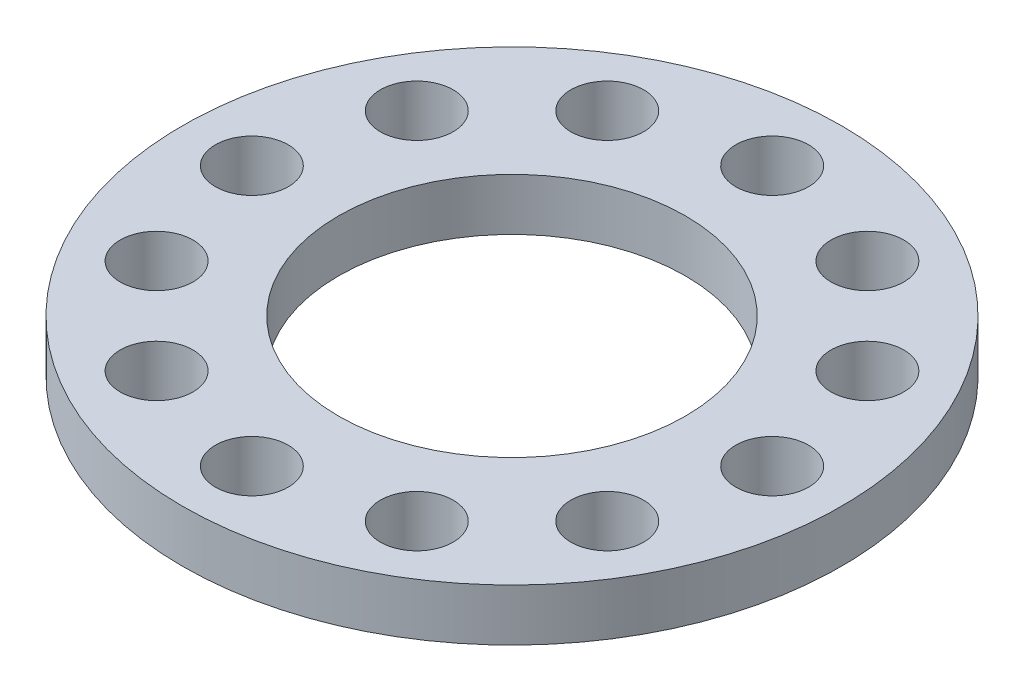
ISO-10303-21;
HEADER;
FILE_DESCRIPTION(('STEP AP214'),'2;1');
FILE_NAME('part.step','',(''),(''),'','','');
FILE_SCHEMA(('AUTOMOTIVE_DESIGN { 1 0 10303 214 1 1 1 1 }'));
ENDSEC;
DATA;
#1=APPLICATION_CONTEXT('core data for automotive mechanical design processes');
#2=APPLICATION_PROTOCOL_DEFINITION('international standard','automotive_design',2000,#1);
#3=PRODUCT_CONTEXT('',#1,'mechanical');
#4=PRODUCT('Part','Part','',(#3));
#5=PRODUCT_RELATED_PRODUCT_CATEGORY('part','',(#4));
#6=PRODUCT_DEFINITION_FORMATION('','',#4);
#7=PRODUCT_DEFINITION_CONTEXT('part definition',#1,'design');
#8=PRODUCT_DEFINITION('design','',#6,#7);
#9=PRODUCT_DEFINITION_SHAPE('','',#8);
#10=(LENGTH_UNIT() NAMED_UNIT(*) SI_UNIT(.MILLI.,.METRE.));
#11=(NAMED_UNIT(*) PLANE_ANGLE_UNIT() SI_UNIT($,.RADIAN.));
#12=(NAMED_UNIT(*) SI_UNIT($,.STERADIAN.) SOLID_ANGLE_UNIT());
#13=UNCERTAINTY_MEASURE_WITH_UNIT(LENGTH_MEASURE(1.E-05),#10,'distance_accuracy_value','');
#14=(GEOMETRIC_REPRESENTATION_CONTEXT(3) GLOBAL_UNCERTAINTY_ASSIGNED_CONTEXT((#13)) GLOBAL_UNIT_ASSIGNED_CONTEXT((#10,
#11,#12)) REPRESENTATION_CONTEXT('',''));
#15=CARTESIAN_POINT('',(0.,0.,0.));
#16=DIRECTION('',(0.,0.,1.));
#17=DIRECTION('',(1.,0.,0.));
#18=AXIS2_PLACEMENT_3D('',#15,#16,#17);
#19=CARTESIAN_POINT('',(0.,3.,0.));
#20=DIRECTION('',(0.,-1.,0.));
#21=DIRECTION('',(0.,0.,-1.));
#22=AXIS2_PLACEMENT_3D('',#19,#20,#21);
#23=CYLINDRICAL_SURFACE('',#22,19.);
#24=CARTESIAN_POINT('',(0.,3.,0.));
#25=DIRECTION('',(0.,1.,0.));
#26=DIRECTION('',(0.,0.,1.));
#27=AXIS2_PLACEMENT_3D('',#24,#25,#26);
#28=CIRCLE('',#27,19.);
#29=CARTESIAN_POINT('',(0.,3.,19.));
#30=VERTEX_POINT('',#29);
#31=EDGE_CURVE('E10',#30,#30,#28,.T.);
#32=ORIENTED_EDGE('',*,*,#31,.F.);
#33=EDGE_LOOP('',(#32));
#34=FACE_BOUND('',#33,.T.);
#35=CARTESIAN_POINT('',(0.,0.,0.));
#36=DIRECTION('',(0.,1.,0.));
#37=DIRECTION('',(0.,0.,1.));
#38=AXIS2_PLACEMENT_3D('',#35,#36,#37);
#39=CIRCLE('',#38,19.);
#40=CARTESIAN_POINT('',(0.,0.,19.));
#41=VERTEX_POINT('',#40);
#42=EDGE_CURVE('E34',#41,#41,#39,.T.);
#43=ORIENTED_EDGE('',*,*,#42,.T.);
#44=EDGE_LOOP('',(#43));
#45=FACE_BOUND('',#44,.T.);
#46=ADVANCED_FACE('F31',(#34,#45),#23,.T.);
#47=CARTESIAN_POINT('',(0.,3.,0.));
#48=DIRECTION('',(0.,1.,0.));
#49=DIRECTION('',(0.,0.,1.));
#50=AXIS2_PLACEMENT_3D('',#47,#48,#49);
#51=PLANE('',#50);
#52=CARTESIAN_POINT('',(0.,3.,0.));
#53=DIRECTION('',(0.,1.,0.));
#54=DIRECTION('',(0.,0.,1.));
#55=AXIS2_PLACEMENT_3D('',#52,#53,#54);
#56=CIRCLE('',#55,10.);
#57=CARTESIAN_POINT('',(0.,3.,10.));
#58=VERTEX_POINT('',#57);
#59=EDGE_CURVE('E117',#58,#58,#56,.T.);
#60=ORIENTED_EDGE('',*,*,#59,.F.);
#61=EDGE_LOOP('',(#60));
#62=FACE_BOUND('',#61,.T.);
#63=CARTESIAN_POINT('',(-7.49999999999992,3.,-12.9903810567663));
#64=DIRECTION('',(0.,1.,0.));
#65=DIRECTION('',(0.,0.,1.));
#66=AXIS2_PLACEMENT_3D('',#63,#64,#65);
#67=CIRCLE('',#66,2.10000000000037);
#68=CARTESIAN_POINT('',(-7.49999999999992,3.,-10.8903810567659));
#69=VERTEX_POINT('',#68);
#70=EDGE_CURVE('E111',#69,#69,#67,.T.);
#71=ORIENTED_EDGE('',*,*,#70,.F.);
#72=EDGE_LOOP('',(#71));
#73=FACE_BOUND('',#72,.T.);
#74=CARTESIAN_POINT('',(-12.9903810567663,3.,-7.49999999999944));
#75=DIRECTION('',(0.,1.,0.));
#76=DIRECTION('',(0.,0.,1.));
#77=AXIS2_PLACEMENT_3D('',#74,#75,#76);
#78=CIRCLE('',#77,2.10000000000064);
#79=CARTESIAN_POINT('',(-12.9903810567663,3.,-5.39999999999879));
#80=VERTEX_POINT('',#79);
#81=EDGE_CURVE('E105',#80,#80,#78,.T.);
#82=ORIENTED_EDGE('',*,*,#81,.F.);
#83=EDGE_LOOP('',(#82));
#84=FACE_BOUND('',#83,.T.);
#85=CARTESIAN_POINT('',(-14.9999999999994,3.,6.3948846218409E-13));
#86=DIRECTION('',(0.,1.,0.));
#87=DIRECTION('',(0.,0.,1.));
#88=AXIS2_PLACEMENT_3D('',#85,#86,#87);
#89=CIRCLE('',#88,2.10000000000095);
#90=CARTESIAN_POINT('',(-14.9999999999994,3.,2.10000000000159));
#91=VERTEX_POINT('',#90);
#92=EDGE_CURVE('E99',#91,#91,#89,.T.);
#93=ORIENTED_EDGE('',*,*,#92,.F.);
#94=EDGE_LOOP('',(#93));
#95=FACE_BOUND('',#94,.T.);
#96=CARTESIAN_POINT('',(-12.9903810567656,3.,7.50000000000056));
#97=DIRECTION('',(0.,1.,0.));
#98=DIRECTION('',(0.,0.,1.));
#99=AXIS2_PLACEMENT_3D('',#96,#97,#98);
#100=CIRCLE('',#99,2.10000000000122);
#101=CARTESIAN_POINT('',(-12.9903810567656,3.,9.60000000000178));
#102=VERTEX_POINT('',#101);
#103=EDGE_CURVE('E93',#102,#102,#100,.T.);
#104=ORIENTED_EDGE('',*,*,#103,.F.);
#105=EDGE_LOOP('',(#104));
#106=FACE_BOUND('',#105,.T.);
#107=CARTESIAN_POINT('',(-7.49999999999881,3.,12.9903810567669));
#108=DIRECTION('',(0.,1.,0.));
#109=DIRECTION('',(0.,0.,1.));
#110=AXIS2_PLACEMENT_3D('',#107,#108,#109);
#111=CIRCLE('',#110,2.10000000000135);
#112=CARTESIAN_POINT('',(-7.49999999999881,3.,15.0903810567683));
#113=VERTEX_POINT('',#112);
#114=EDGE_CURVE('E87',#113,#113,#111,.T.);
#115=ORIENTED_EDGE('',*,*,#114,.F.);
#116=EDGE_LOOP('',(#115));
#117=FACE_BOUND('',#116,.T.);
#118=CARTESIAN_POINT('',(1.27530298397074E-12,3.,15.));
#119=DIRECTION('',(0.,1.,0.));
#120=DIRECTION('',(0.,0.,1.));
#121=AXIS2_PLACEMENT_3D('',#118,#119,#120);
#122=CIRCLE('',#121,2.10000000000132);
#123=CARTESIAN_POINT('',(1.27530298397074E-12,3.,17.1000000000013));
#124=VERTEX_POINT('',#123);
#125=EDGE_CURVE('E81',#124,#124,#122,.T.);
#126=ORIENTED_EDGE('',*,*,#125,.F.);
#127=EDGE_LOOP('',(#126));
#128=FACE_BOUND('',#127,.T.);
#129=CARTESIAN_POINT('',(7.50000000000119,3.,12.9903810567663));
#130=DIRECTION('',(0.,1.,0.));
#131=DIRECTION('',(0.,0.,1.));
#132=AXIS2_PLACEMENT_3D('',#129,#130,#131);
#133=CIRCLE('',#132,2.10000000000113);
#134=CARTESIAN_POINT('',(7.50000000000119,3.,15.0903810567674));
#135=VERTEX_POINT('',#134);
#136=EDGE_CURVE('E75',#135,#135,#133,.T.);
#137=ORIENTED_EDGE('',*,*,#136,.F.);
#138=EDGE_LOOP('',(#137));
#139=FACE_BOUND('',#138,.T.);
#140=CARTESIAN_POINT('',(12.9903810567675,3.,7.49999999999945));
#141=DIRECTION('',(0.,1.,0.));
#142=DIRECTION('',(0.,0.,1.));
#143=AXIS2_PLACEMENT_3D('',#140,#141,#142);
#144=CIRCLE('',#143,2.10000000000082);
#145=CARTESIAN_POINT('',(12.9903810567675,3.,9.60000000000027));
#146=VERTEX_POINT('',#145);
#147=EDGE_CURVE('E69',#146,#146,#144,.T.);
#148=ORIENTED_EDGE('',*,*,#147,.F.);
#149=EDGE_LOOP('',(#148));
#150=FACE_BOUND('',#149,.T.);
#151=CARTESIAN_POINT('',(15.0000000000006,3.,-6.37651491985369E-13));
#152=DIRECTION('',(0.,1.,0.));
#153=DIRECTION('',(0.,0.,1.));
#154=AXIS2_PLACEMENT_3D('',#151,#152,#153);
#155=CIRCLE('',#154,2.10000000000047);
#156=CARTESIAN_POINT('',(15.0000000000006,3.,2.09999999999984));
#157=VERTEX_POINT('',#156);
#158=EDGE_CURVE('E63',#157,#157,#155,.T.);
#159=ORIENTED_EDGE('',*,*,#158,.F.);
#160=EDGE_LOOP('',(#159));
#161=FACE_BOUND('',#160,.T.);
#162=CARTESIAN_POINT('',(12.9903810567669,3.,-7.50000000000055));
#163=DIRECTION('',(0.,1.,0.));
#164=DIRECTION('',(0.,0.,1.));
#165=AXIS2_PLACEMENT_3D('',#162,#163,#164);
#166=CIRCLE('',#165,2.10000000000018);
#167=CARTESIAN_POINT('',(12.9903810567669,3.,-5.40000000000038));
#168=VERTEX_POINT('',#167);
#169=EDGE_CURVE('E57',#168,#168,#166,.T.);
#170=ORIENTED_EDGE('',*,*,#169,.F.);
#171=EDGE_LOOP('',(#170));
#172=FACE_BOUND('',#171,.T.);
#173=CARTESIAN_POINT('',(7.50000000000001,3.,-12.9903810567666));
#174=DIRECTION('',(0.,1.,0.));
#175=DIRECTION('',(0.,0.,1.));
#176=AXIS2_PLACEMENT_3D('',#173,#174,#175);
#177=CIRCLE('',#176,2.1);
#178=CARTESIAN_POINT('',(7.50000000000001,3.,-10.8903810567666));
#179=VERTEX_POINT('',#178);
#180=EDGE_CURVE('E51',#179,#179,#177,.T.);
#181=ORIENTED_EDGE('',*,*,#180,.F.);
#182=EDGE_LOOP('',(#181));
#183=FACE_BOUND('',#182,.T.);
#184=CARTESIAN_POINT('',(0.,3.,-15.));
#185=DIRECTION('',(0.,1.,0.));
#186=DIRECTION('',(0.,0.,1.));
#187=AXIS2_PLACEMENT_3D('',#184,#185,#186);
#188=CIRCLE('',#187,2.1);
#189=CARTESIAN_POINT('',(0.,3.,-12.9));
#190=VERTEX_POINT('',#189);
#191=EDGE_CURVE('E45',#190,#190,#188,.T.);
#192=ORIENTED_EDGE('',*,*,#191,.F.);
#193=EDGE_LOOP('',(#192));
#194=FACE_BOUND('',#193,.T.);
#195=ORIENTED_EDGE('',*,*,#31,.T.);
#196=EDGE_LOOP('',(#195));
#197=FACE_BOUND('',#196,.T.);
#198=ADVANCED_FACE('F124',(#62,#73,#84,#95,#106,#117,#128,#139,#150,#161,#172,#183,#194,#197),
#51,.T.);
#199=CARTESIAN_POINT('',(0.,0.,0.));
#200=DIRECTION('',(0.,1.,0.));
#201=DIRECTION('',(0.,0.,1.));
#202=AXIS2_PLACEMENT_3D('',#199,#200,#201);
#203=PLANE('',#202);
#204=CARTESIAN_POINT('',(0.,0.,0.));
#205=DIRECTION('',(0.,1.,0.));
#206=DIRECTION('',(0.,0.,1.));
#207=AXIS2_PLACEMENT_3D('',#204,#205,#206);
#208=CIRCLE('',#207,10.);
#209=CARTESIAN_POINT('',(0.,0.,10.));
#210=VERTEX_POINT('',#209);
#211=EDGE_CURVE('E114',#210,#210,#208,.F.);
#212=ORIENTED_EDGE('',*,*,#211,.F.);
#213=EDGE_LOOP('',(#212));
#214=FACE_BOUND('',#213,.T.);
#215=CARTESIAN_POINT('',(-7.49999999999992,0.,-12.9903810567663));
#216=DIRECTION('',(0.,1.,0.));
#217=DIRECTION('',(0.,0.,1.));
#218=AXIS2_PLACEMENT_3D('',#215,#216,#217);
#219=CIRCLE('',#218,2.10000000000037);
#220=CARTESIAN_POINT('',(-7.49999999999992,0.,-10.8903810567659));
#221=VERTEX_POINT('',#220);
#222=EDGE_CURVE('E108',#221,#221,#219,.F.);
#223=ORIENTED_EDGE('',*,*,#222,.F.);
#224=EDGE_LOOP('',(#223));
#225=FACE_BOUND('',#224,.T.);
#226=CARTESIAN_POINT('',(-12.9903810567663,0.,-7.49999999999944));
#227=DIRECTION('',(0.,1.,0.));
#228=DIRECTION('',(0.,0.,1.));
#229=AXIS2_PLACEMENT_3D('',#226,#227,#228);
#230=CIRCLE('',#229,2.10000000000064);
#231=CARTESIAN_POINT('',(-12.9903810567663,0.,-5.39999999999879));
#232=VERTEX_POINT('',#231);
#233=EDGE_CURVE('E102',#232,#232,#230,.F.);
#234=ORIENTED_EDGE('',*,*,#233,.F.);
#235=EDGE_LOOP('',(#234));
#236=FACE_BOUND('',#235,.T.);
#237=CARTESIAN_POINT('',(-14.9999999999994,0.,6.3948846218409E-13));
#238=DIRECTION('',(0.,1.,0.));
#239=DIRECTION('',(0.,0.,1.));
#240=AXIS2_PLACEMENT_3D('',#237,#238,#239);
#241=CIRCLE('',#240,2.10000000000095);
#242=CARTESIAN_POINT('',(-14.9999999999994,0.,2.10000000000159));
#243=VERTEX_POINT('',#242);
#244=EDGE_CURVE('E96',#243,#243,#241,.F.);
#245=ORIENTED_EDGE('',*,*,#244,.F.);
#246=EDGE_LOOP('',(#245));
#247=FACE_BOUND('',#246,.T.);
#248=CARTESIAN_POINT('',(-12.9903810567656,0.,7.50000000000056));
#249=DIRECTION('',(0.,1.,0.));
#250=DIRECTION('',(0.,0.,1.));
#251=AXIS2_PLACEMENT_3D('',#248,#249,#250);
#252=CIRCLE('',#251,2.10000000000122);
#253=CARTESIAN_POINT('',(-12.9903810567656,0.,9.60000000000178));
#254=VERTEX_POINT('',#253);
#255=EDGE_CURVE('E90',#254,#254,#252,.F.);
#256=ORIENTED_EDGE('',*,*,#255,.F.);
#257=EDGE_LOOP('',(#256));
#258=FACE_BOUND('',#257,.T.);
#259=CARTESIAN_POINT('',(-7.49999999999881,0.,12.9903810567669));
#260=DIRECTION('',(0.,1.,0.));
#261=DIRECTION('',(0.,0.,1.));
#262=AXIS2_PLACEMENT_3D('',#259,#260,#261);
#263=CIRCLE('',#262,2.10000000000135);
#264=CARTESIAN_POINT('',(-7.49999999999881,0.,15.0903810567683));
#265=VERTEX_POINT('',#264);
#266=EDGE_CURVE('E84',#265,#265,#263,.F.);
#267=ORIENTED_EDGE('',*,*,#266,.F.);
#268=EDGE_LOOP('',(#267));
#269=FACE_BOUND('',#268,.T.);
#270=CARTESIAN_POINT('',(1.27530298397074E-12,0.,15.));
#271=DIRECTION('',(0.,1.,0.));
#272=DIRECTION('',(0.,0.,1.));
#273=AXIS2_PLACEMENT_3D('',#270,#271,#272);
#274=CIRCLE('',#273,2.10000000000132);
#275=CARTESIAN_POINT('',(1.27530298397074E-12,0.,17.1000000000013));
#276=VERTEX_POINT('',#275);
#277=EDGE_CURVE('E78',#276,#276,#274,.F.);
#278=ORIENTED_EDGE('',*,*,#277,.F.);
#279=EDGE_LOOP('',(#278));
#280=FACE_BOUND('',#279,.T.);
#281=CARTESIAN_POINT('',(7.50000000000119,0.,12.9903810567663));
#282=DIRECTION('',(0.,1.,0.));
#283=DIRECTION('',(0.,0.,1.));
#284=AXIS2_PLACEMENT_3D('',#281,#282,#283);
#285=CIRCLE('',#284,2.10000000000113);
#286=CARTESIAN_POINT('',(7.50000000000119,0.,15.0903810567674));
#287=VERTEX_POINT('',#286);
#288=EDGE_CURVE('E72',#287,#287,#285,.F.);
#289=ORIENTED_EDGE('',*,*,#288,.F.);
#290=EDGE_LOOP('',(#289));
#291=FACE_BOUND('',#290,.T.);
#292=CARTESIAN_POINT('',(12.9903810567675,0.,7.49999999999945));
#293=DIRECTION('',(0.,1.,0.));
#294=DIRECTION('',(0.,0.,1.));
#295=AXIS2_PLACEMENT_3D('',#292,#293,#294);
#296=CIRCLE('',#295,2.10000000000082);
#297=CARTESIAN_POINT('',(12.9903810567675,0.,9.60000000000027));
#298=VERTEX_POINT('',#297);
#299=EDGE_CURVE('E66',#298,#298,#296,.F.);
#300=ORIENTED_EDGE('',*,*,#299,.F.);
#301=EDGE_LOOP('',(#300));
#302=FACE_BOUND('',#301,.T.);
#303=CARTESIAN_POINT('',(15.0000000000006,0.,-6.37651491985369E-13));
#304=DIRECTION('',(0.,1.,0.));
#305=DIRECTION('',(0.,0.,1.));
#306=AXIS2_PLACEMENT_3D('',#303,#304,#305);
#307=CIRCLE('',#306,2.10000000000047);
#308=CARTESIAN_POINT('',(15.0000000000006,0.,2.09999999999984));
#309=VERTEX_POINT('',#308);
#310=EDGE_CURVE('E60',#309,#309,#307,.F.);
#311=ORIENTED_EDGE('',*,*,#310,.F.);
#312=EDGE_LOOP('',(#311));
#313=FACE_BOUND('',#312,.T.);
#314=CARTESIAN_POINT('',(12.9903810567669,0.,-7.50000000000055));
#315=DIRECTION('',(0.,1.,0.));
#316=DIRECTION('',(0.,0.,1.));
#317=AXIS2_PLACEMENT_3D('',#314,#315,#316);
#318=CIRCLE('',#317,2.10000000000018);
#319=CARTESIAN_POINT('',(12.9903810567669,0.,-5.40000000000038));
#320=VERTEX_POINT('',#319);
#321=EDGE_CURVE('E54',#320,#320,#318,.F.);
#322=ORIENTED_EDGE('',*,*,#321,.F.);
#323=EDGE_LOOP('',(#322));
#324=FACE_BOUND('',#323,.T.);
#325=CARTESIAN_POINT('',(7.50000000000001,0.,-12.9903810567666));
#326=DIRECTION('',(0.,1.,0.));
#327=DIRECTION('',(0.,0.,1.));
#328=AXIS2_PLACEMENT_3D('',#325,#326,#327);
#329=CIRCLE('',#328,2.1);
#330=CARTESIAN_POINT('',(7.50000000000001,0.,-10.8903810567666));
#331=VERTEX_POINT('',#330);
#332=EDGE_CURVE('E48',#331,#331,#329,.F.);
#333=ORIENTED_EDGE('',*,*,#332,.F.);
#334=EDGE_LOOP('',(#333));
#335=FACE_BOUND('',#334,.T.);
#336=CARTESIAN_POINT('',(0.,0.,-15.));
#337=DIRECTION('',(0.,1.,0.));
#338=DIRECTION('',(0.,0.,1.));
#339=AXIS2_PLACEMENT_3D('',#336,#337,#338);
#340=CIRCLE('',#339,2.1);
#341=CARTESIAN_POINT('',(0.,0.,-12.9));
#342=VERTEX_POINT('',#341);
#343=EDGE_CURVE('E41',#342,#342,#340,.F.);
#344=ORIENTED_EDGE('',*,*,#343,.F.);
#345=EDGE_LOOP('',(#344));
#346=FACE_BOUND('',#345,.T.);
#347=ORIENTED_EDGE('',*,*,#42,.F.);
#348=EDGE_LOOP('',(#347));
#349=FACE_BOUND('',#348,.T.);
#350=ADVANCED_FACE('F127',(#214,#225,#236,#247,#258,#269,#280,#291,#302,#313,#324,#335,#346,
#349),#203,.F.);
#351=CARTESIAN_POINT('',(0.,-0.00100000000000013,-15.));
#352=DIRECTION('',(0.,1.,0.));
#353=DIRECTION('',(0.,0.,1.));
#354=AXIS2_PLACEMENT_3D('',#351,#352,#353);
#355=CYLINDRICAL_SURFACE('',#354,2.1);
#356=ORIENTED_EDGE('',*,*,#191,.T.);
#357=EDGE_LOOP('',(#356));
#358=FACE_BOUND('',#357,.T.);
#359=ORIENTED_EDGE('',*,*,#343,.T.);
#360=EDGE_LOOP('',(#359));
#361=FACE_BOUND('',#360,.T.);
#362=ADVANCED_FACE('F153',(#358,#361),#355,.F.);
#363=CARTESIAN_POINT('',(7.50000000000001,-0.00100000000000013,-12.9903810567666));
#364=DIRECTION('',(0.,1.,0.));
#365=DIRECTION('',(0.,0.,1.));
#366=AXIS2_PLACEMENT_3D('',#363,#364,#365);
#367=CYLINDRICAL_SURFACE('',#366,2.1);
#368=ORIENTED_EDGE('',*,*,#180,.T.);
#369=EDGE_LOOP('',(#368));
#370=FACE_BOUND('',#369,.T.);
#371=ORIENTED_EDGE('',*,*,#332,.T.);
#372=EDGE_LOOP('',(#371));
#373=FACE_BOUND('',#372,.T.);
#374=ADVANCED_FACE('F156',(#370,#373),#367,.F.);
#375=CARTESIAN_POINT('',(12.9903810567669,-0.00100000000000013,-7.50000000000055));
#376=DIRECTION('',(0.,1.,0.));
#377=DIRECTION('',(0.,0.,1.));
#378=AXIS2_PLACEMENT_3D('',#375,#376,#377);
#379=CYLINDRICAL_SURFACE('',#378,2.10000000000018);
#380=ORIENTED_EDGE('',*,*,#169,.T.);
#381=EDGE_LOOP('',(#380));
#382=FACE_BOUND('',#381,.T.);
#383=ORIENTED_EDGE('',*,*,#321,.T.);
#384=EDGE_LOOP('',(#383));
#385=FACE_BOUND('',#384,.T.);
#386=ADVANCED_FACE('F189',(#382,#385),#379,.F.);
#387=CARTESIAN_POINT('',(15.0000000000006,-0.00100000000000013,-6.37651491985369E-13));
#388=DIRECTION('',(0.,1.,0.));
#389=DIRECTION('',(0.,0.,1.));
#390=AXIS2_PLACEMENT_3D('',#387,#388,#389);
#391=CYLINDRICAL_SURFACE('',#390,2.10000000000047);
#392=ORIENTED_EDGE('',*,*,#158,.T.);
#393=EDGE_LOOP('',(#392));
#394=FACE_BOUND('',#393,.T.);
#395=ORIENTED_EDGE('',*,*,#310,.T.);
#396=EDGE_LOOP('',(#395));
#397=FACE_BOUND('',#396,.T.);
#398=ADVANCED_FACE('F197',(#394,#397),#391,.F.);
#399=CARTESIAN_POINT('',(12.9903810567675,-0.00100000000000013,7.49999999999945));
#400=DIRECTION('',(0.,1.,0.));
#401=DIRECTION('',(0.,0.,1.));
#402=AXIS2_PLACEMENT_3D('',#399,#400,#401);
#403=CYLINDRICAL_SURFACE('',#402,2.10000000000082);
#404=ORIENTED_EDGE('',*,*,#147,.T.);
#405=EDGE_LOOP('',(#404));
#406=FACE_BOUND('',#405,.T.);
#407=ORIENTED_EDGE('',*,*,#299,.T.);
#408=EDGE_LOOP('',(#407));
#409=FACE_BOUND('',#408,.T.);
#410=ADVANCED_FACE('F205',(#406,#409),#403,.F.);
#411=CARTESIAN_POINT('',(7.50000000000119,-0.00100000000000013,12.9903810567663));
#412=DIRECTION('',(0.,1.,0.));
#413=DIRECTION('',(0.,0.,1.));
#414=AXIS2_PLACEMENT_3D('',#411,#412,#413);
#415=CYLINDRICAL_SURFACE('',#414,2.10000000000113);
#416=ORIENTED_EDGE('',*,*,#136,.T.);
#417=EDGE_LOOP('',(#416));
#418=FACE_BOUND('',#417,.T.);
#419=ORIENTED_EDGE('',*,*,#288,.T.);
#420=EDGE_LOOP('',(#419));
#421=FACE_BOUND('',#420,.T.);
#422=ADVANCED_FACE('F213',(#418,#421),#415,.F.);
#423=CARTESIAN_POINT('',(1.27530298397074E-12,-0.00100000000000013,15.));
#424=DIRECTION('',(0.,1.,0.));
#425=DIRECTION('',(0.,0.,1.));
#426=AXIS2_PLACEMENT_3D('',#423,#424,#425);
#427=CYLINDRICAL_SURFACE('',#426,2.10000000000132);
#428=ORIENTED_EDGE('',*,*,#125,.T.);
#429=EDGE_LOOP('',(#428));
#430=FACE_BOUND('',#429,.T.);
#431=ORIENTED_EDGE('',*,*,#277,.T.);
#432=EDGE_LOOP('',(#431));
#433=FACE_BOUND('',#432,.T.);
#434=ADVANCED_FACE('F221',(#430,#433),#427,.F.);
#435=CARTESIAN_POINT('',(-7.49999999999881,-0.00100000000000013,12.9903810567669));
#436=DIRECTION('',(0.,1.,0.));
#437=DIRECTION('',(0.,0.,1.));
#438=AXIS2_PLACEMENT_3D('',#435,#436,#437);
#439=CYLINDRICAL_SURFACE('',#438,2.10000000000135);
#440=ORIENTED_EDGE('',*,*,#114,.T.);
#441=EDGE_LOOP('',(#440));
#442=FACE_BOUND('',#441,.T.);
#443=ORIENTED_EDGE('',*,*,#266,.T.);
#444=EDGE_LOOP('',(#443));
#445=FACE_BOUND('',#444,.T.);
#446=ADVANCED_FACE('F229',(#442,#445),#439,.F.);
#447=CARTESIAN_POINT('',(-12.9903810567656,-0.00100000000000013,7.50000000000056));
#448=DIRECTION('',(0.,1.,0.));
#449=DIRECTION('',(0.,0.,1.));
#450=AXIS2_PLACEMENT_3D('',#447,#448,#449);
#451=CYLINDRICAL_SURFACE('',#450,2.10000000000122);
#452=ORIENTED_EDGE('',*,*,#103,.T.);
#453=EDGE_LOOP('',(#452));
#454=FACE_BOUND('',#453,.T.);
#455=ORIENTED_EDGE('',*,*,#255,.T.);
#456=EDGE_LOOP('',(#455));
#457=FACE_BOUND('',#456,.T.);
#458=ADVANCED_FACE('F237',(#454,#457),#451,.F.);
#459=CARTESIAN_POINT('',(-14.9999999999994,-0.00100000000000013,6.3948846218409E-13));
#460=DIRECTION('',(0.,1.,0.));
#461=DIRECTION('',(0.,0.,1.));
#462=AXIS2_PLACEMENT_3D('',#459,#460,#461);
#463=CYLINDRICAL_SURFACE('',#462,2.10000000000095);
#464=ORIENTED_EDGE('',*,*,#92,.T.);
#465=EDGE_LOOP('',(#464));
#466=FACE_BOUND('',#465,.T.);
#467=ORIENTED_EDGE('',*,*,#244,.T.);
#468=EDGE_LOOP('',(#467));
#469=FACE_BOUND('',#468,.T.);
#470=ADVANCED_FACE('F245',(#466,#469),#463,.F.);
#471=CARTESIAN_POINT('',(-12.9903810567663,-0.00100000000000013,-7.49999999999944));
#472=DIRECTION('',(0.,1.,0.));
#473=DIRECTION('',(0.,0.,1.));
#474=AXIS2_PLACEMENT_3D('',#471,#472,#473);
#475=CYLINDRICAL_SURFACE('',#474,2.10000000000064);
#476=ORIENTED_EDGE('',*,*,#81,.T.);
#477=EDGE_LOOP('',(#476));
#478=FACE_BOUND('',#477,.T.);
#479=ORIENTED_EDGE('',*,*,#233,.T.);
#480=EDGE_LOOP('',(#479));
#481=FACE_BOUND('',#480,.T.);
#482=ADVANCED_FACE('F253',(#478,#481),#475,.F.);
#483=CARTESIAN_POINT('',(-7.49999999999992,-0.00100000000000013,-12.9903810567663));
#484=DIRECTION('',(0.,1.,0.));
#485=DIRECTION('',(0.,0.,1.));
#486=AXIS2_PLACEMENT_3D('',#483,#484,#485);
#487=CYLINDRICAL_SURFACE('',#486,2.10000000000037);
#488=ORIENTED_EDGE('',*,*,#70,.T.);
#489=EDGE_LOOP('',(#488));
#490=FACE_BOUND('',#489,.T.);
#491=ORIENTED_EDGE('',*,*,#222,.T.);
#492=EDGE_LOOP('',(#491));
#493=FACE_BOUND('',#492,.T.);
#494=ADVANCED_FACE('F261',(#490,#493),#487,.F.);
#495=CARTESIAN_POINT('',(0.,-0.00100000000000013,0.));
#496=DIRECTION('',(0.,1.,0.));
#497=DIRECTION('',(0.,0.,1.));
#498=AXIS2_PLACEMENT_3D('',#495,#496,#497);
#499=CYLINDRICAL_SURFACE('',#498,10.);
#500=ORIENTED_EDGE('',*,*,#59,.T.);
#501=EDGE_LOOP('',(#500));
#502=FACE_BOUND('',#501,.T.);
#503=ORIENTED_EDGE('',*,*,#211,.T.);
#504=EDGE_LOOP('',(#503));
#505=FACE_BOUND('',#504,.T.);
#506=ADVANCED_FACE('F121',(#502,#505),#499,.F.);
#507=CLOSED_SHELL('',(#46,#198,#350,#362,#374,#386,#398,#410,#422,#434,#446,#458,#470,#482,#494,#506));
#508=MANIFOLD_SOLID_BREP('B2',#507);
#509=ADVANCED_BREP_SHAPE_REPRESENTATION('',(#18,#508),#14);
#510=SHAPE_DEFINITION_REPRESENTATION(#9,#509);
ENDSEC;
END-ISO-10303-21;
